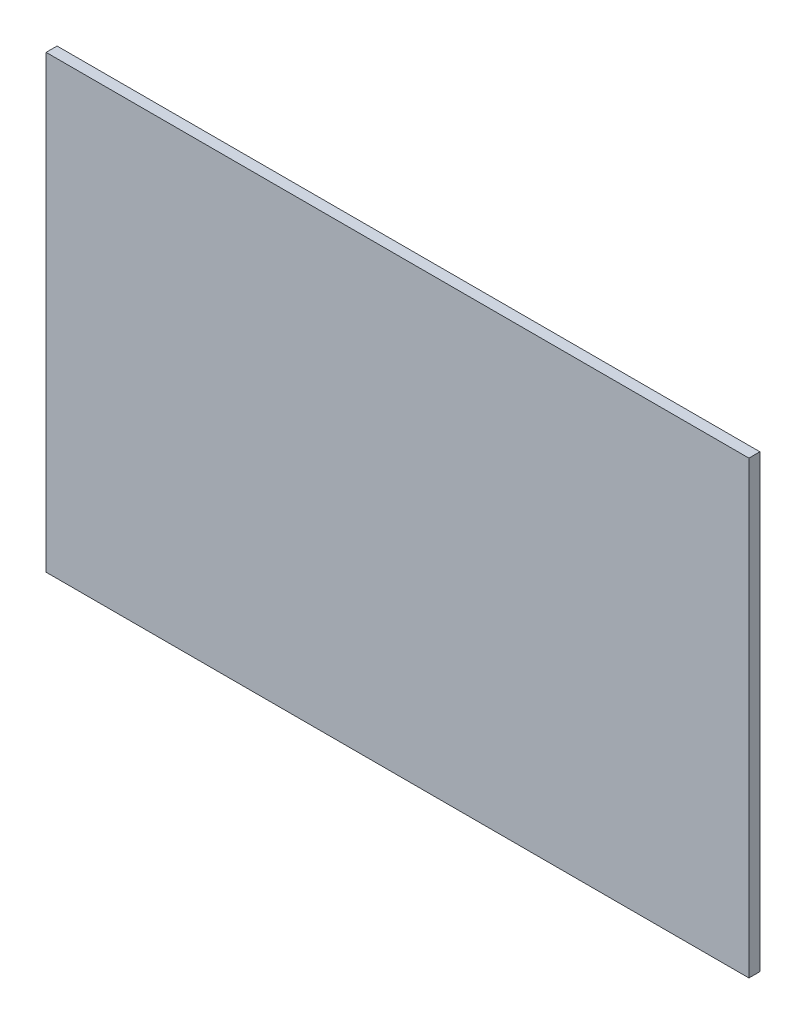
ISO-10303-21;
HEADER;
FILE_DESCRIPTION(('STEP AP214'),'2;1');
FILE_NAME('part.step','',(''),(''),'','','');
FILE_SCHEMA(('AUTOMOTIVE_DESIGN { 1 0 10303 214 1 1 1 1 }'));
ENDSEC;
DATA;
#1=APPLICATION_CONTEXT('core data for automotive mechanical design processes');
#2=APPLICATION_PROTOCOL_DEFINITION('international standard','automotive_design',2000,#1);
#3=PRODUCT_CONTEXT('',#1,'mechanical');
#4=PRODUCT('Part','Part','',(#3));
#5=PRODUCT_RELATED_PRODUCT_CATEGORY('part','',(#4));
#6=PRODUCT_DEFINITION_FORMATION('','',#4);
#7=PRODUCT_DEFINITION_CONTEXT('part definition',#1,'design');
#8=PRODUCT_DEFINITION('design','',#6,#7);
#9=PRODUCT_DEFINITION_SHAPE('','',#8);
#10=(LENGTH_UNIT() NAMED_UNIT(*) SI_UNIT(.MILLI.,.METRE.));
#11=(NAMED_UNIT(*) PLANE_ANGLE_UNIT() SI_UNIT($,.RADIAN.));
#12=(NAMED_UNIT(*) SI_UNIT($,.STERADIAN.) SOLID_ANGLE_UNIT());
#13=UNCERTAINTY_MEASURE_WITH_UNIT(LENGTH_MEASURE(1.E-05),#10,'distance_accuracy_value','');
#14=(GEOMETRIC_REPRESENTATION_CONTEXT(3) GLOBAL_UNCERTAINTY_ASSIGNED_CONTEXT((#13)) GLOBAL_UNIT_ASSIGNED_CONTEXT((#10,
#11,#12)) REPRESENTATION_CONTEXT('',''));
#15=CARTESIAN_POINT('',(0.,0.,0.));
#16=DIRECTION('',(0.,0.,1.));
#17=DIRECTION('',(1.,0.,0.));
#18=AXIS2_PLACEMENT_3D('',#15,#16,#17);
#19=CARTESIAN_POINT('',(160.,102.5,-5.));
#20=DIRECTION('',(1.,0.,0.));
#21=DIRECTION('',(0.,1.,0.));
#22=AXIS2_PLACEMENT_3D('',#19,#20,#21);
#23=PLANE('',#22);
#24=DIRECTION('',(0.,1.,0.));
#25=VECTOR('',#24,1.);
#26=CARTESIAN_POINT('',(160.,102.5,0.));
#27=LINE('',#26,#25);
#28=CARTESIAN_POINT('',(160.,-102.5,0.));
#29=VERTEX_POINT('',#28);
#30=CARTESIAN_POINT('',(160.,102.5,0.));
#31=VERTEX_POINT('',#30);
#32=EDGE_CURVE('E103',#29,#31,#27,.T.);
#33=ORIENTED_EDGE('',*,*,#32,.F.);
#34=DIRECTION('',(0.,0.,1.));
#35=VECTOR('',#34,1.);
#36=CARTESIAN_POINT('',(160.,-102.5,-5.));
#37=LINE('',#36,#35);
#38=CARTESIAN_POINT('',(160.,-102.5,-5.));
#39=VERTEX_POINT('',#38);
#40=EDGE_CURVE('E11',#39,#29,#37,.T.);
#41=ORIENTED_EDGE('',*,*,#40,.F.);
#42=DIRECTION('',(0.,1.,0.));
#43=VECTOR('',#42,1.);
#44=CARTESIAN_POINT('',(160.,102.5,-5.));
#45=LINE('',#44,#43);
#46=CARTESIAN_POINT('',(160.,102.5,-5.));
#47=VERTEX_POINT('',#46);
#48=EDGE_CURVE('E97',#39,#47,#45,.T.);
#49=ORIENTED_EDGE('',*,*,#48,.T.);
#50=DIRECTION('',(0.,0.,1.));
#51=VECTOR('',#50,1.);
#52=CARTESIAN_POINT('',(160.,102.5,-5.));
#53=LINE('',#52,#51);
#54=EDGE_CURVE('E42',#47,#31,#53,.T.);
#55=ORIENTED_EDGE('',*,*,#54,.T.);
#56=EDGE_LOOP('',(#33,#41,#49,#55));
#57=FACE_BOUND('',#56,.T.);
#58=ADVANCED_FACE('F39',(#57),#23,.T.);
#59=CARTESIAN_POINT('',(-160.,-102.5,-5.));
#60=DIRECTION('',(0.,-1.,0.));
#61=DIRECTION('',(0.,0.,-1.));
#62=AXIS2_PLACEMENT_3D('',#59,#60,#61);
#63=PLANE('',#62);
#64=DIRECTION('',(1.,0.,0.));
#65=VECTOR('',#64,1.);
#66=CARTESIAN_POINT('',(-160.,-102.5,0.));
#67=LINE('',#66,#65);
#68=CARTESIAN_POINT('',(-160.,-102.5,0.));
#69=VERTEX_POINT('',#68);
#70=EDGE_CURVE('E99',#69,#29,#67,.T.);
#71=ORIENTED_EDGE('',*,*,#70,.F.);
#72=DIRECTION('',(0.,0.,1.));
#73=VECTOR('',#72,1.);
#74=CARTESIAN_POINT('',(-160.,-102.5,-5.));
#75=LINE('',#74,#73);
#76=CARTESIAN_POINT('',(-160.,-102.5,-5.));
#77=VERTEX_POINT('',#76);
#78=EDGE_CURVE('E48',#77,#69,#75,.T.);
#79=ORIENTED_EDGE('',*,*,#78,.F.);
#80=DIRECTION('',(1.,0.,0.));
#81=VECTOR('',#80,1.);
#82=CARTESIAN_POINT('',(-160.,-102.5,-5.));
#83=LINE('',#82,#81);
#84=EDGE_CURVE('E94',#77,#39,#83,.T.);
#85=ORIENTED_EDGE('',*,*,#84,.T.);
#86=ORIENTED_EDGE('',*,*,#40,.T.);
#87=EDGE_LOOP('',(#71,#79,#85,#86));
#88=FACE_BOUND('',#87,.T.);
#89=ADVANCED_FACE('F113',(#88),#63,.T.);
#90=CARTESIAN_POINT('',(-160.,102.5,-5.));
#91=DIRECTION('',(-1.,0.,0.));
#92=DIRECTION('',(0.,0.,1.));
#93=AXIS2_PLACEMENT_3D('',#90,#91,#92);
#94=PLANE('',#93);
#95=DIRECTION('',(0.,-1.,0.));
#96=VECTOR('',#95,1.);
#97=CARTESIAN_POINT('',(-160.,102.5,0.));
#98=LINE('',#97,#96);
#99=CARTESIAN_POINT('',(-160.,102.5,0.));
#100=VERTEX_POINT('',#99);
#101=EDGE_CURVE('E89',#100,#69,#98,.T.);
#102=ORIENTED_EDGE('',*,*,#101,.F.);
#103=DIRECTION('',(0.,0.,1.));
#104=VECTOR('',#103,1.);
#105=CARTESIAN_POINT('',(-160.,102.5,-5.));
#106=LINE('',#105,#104);
#107=CARTESIAN_POINT('',(-160.,102.5,-5.));
#108=VERTEX_POINT('',#107);
#109=EDGE_CURVE('E84',#108,#100,#106,.T.);
#110=ORIENTED_EDGE('',*,*,#109,.F.);
#111=DIRECTION('',(0.,-1.,0.));
#112=VECTOR('',#111,1.);
#113=CARTESIAN_POINT('',(-160.,102.5,-5.));
#114=LINE('',#113,#112);
#115=EDGE_CURVE('E87',#108,#77,#114,.T.);
#116=ORIENTED_EDGE('',*,*,#115,.T.);
#117=ORIENTED_EDGE('',*,*,#78,.T.);
#118=EDGE_LOOP('',(#102,#110,#116,#117));
#119=FACE_BOUND('',#118,.T.);
#120=ADVANCED_FACE('F86',(#119),#94,.T.);
#121=CARTESIAN_POINT('',(-160.,102.5,-5.));
#122=DIRECTION('',(0.,1.,0.));
#123=DIRECTION('',(0.,0.,1.));
#124=AXIS2_PLACEMENT_3D('',#121,#122,#123);
#125=PLANE('',#124);
#126=DIRECTION('',(-1.,0.,0.));
#127=VECTOR('',#126,1.);
#128=CARTESIAN_POINT('',(-160.,102.5,0.));
#129=LINE('',#128,#127);
#130=EDGE_CURVE('E106',#31,#100,#129,.T.);
#131=ORIENTED_EDGE('',*,*,#130,.F.);
#132=ORIENTED_EDGE('',*,*,#54,.F.);
#133=DIRECTION('',(-1.,0.,0.));
#134=VECTOR('',#133,1.);
#135=CARTESIAN_POINT('',(-160.,102.5,-5.));
#136=LINE('',#135,#134);
#137=EDGE_CURVE('E93',#47,#108,#136,.T.);
#138=ORIENTED_EDGE('',*,*,#137,.T.);
#139=ORIENTED_EDGE('',*,*,#109,.T.);
#140=EDGE_LOOP('',(#131,#132,#138,#139));
#141=FACE_BOUND('',#140,.T.);
#142=ADVANCED_FACE('F96',(#141),#125,.T.);
#143=CARTESIAN_POINT('',(0.,0.,-5.));
#144=DIRECTION('',(0.,0.,1.));
#145=DIRECTION('',(1.,0.,0.));
#146=AXIS2_PLACEMENT_3D('',#143,#144,#145);
#147=PLANE('',#146);
#148=ORIENTED_EDGE('',*,*,#48,.F.);
#149=ORIENTED_EDGE('',*,*,#84,.F.);
#150=ORIENTED_EDGE('',*,*,#115,.F.);
#151=ORIENTED_EDGE('',*,*,#137,.F.);
#152=EDGE_LOOP('',(#148,#149,#150,#151));
#153=FACE_BOUND('',#152,.T.);
#154=ADVANCED_FACE('F92',(#153),#147,.F.);
#155=CARTESIAN_POINT('',(0.,0.,0.));
#156=DIRECTION('',(0.,0.,1.));
#157=DIRECTION('',(1.,0.,0.));
#158=AXIS2_PLACEMENT_3D('',#155,#156,#157);
#159=PLANE('',#158);
#160=ORIENTED_EDGE('',*,*,#32,.T.);
#161=ORIENTED_EDGE('',*,*,#130,.T.);
#162=ORIENTED_EDGE('',*,*,#101,.T.);
#163=ORIENTED_EDGE('',*,*,#70,.T.);
#164=EDGE_LOOP('',(#160,#161,#162,#163));
#165=FACE_BOUND('',#164,.T.);
#166=ADVANCED_FACE('F112',(#165),#159,.T.);
#167=CLOSED_SHELL('',(#58,#89,#120,#142,#154,#166));
#168=MANIFOLD_SOLID_BREP('B2',#167);
#169=ADVANCED_BREP_SHAPE_REPRESENTATION('',(#18,#168),#14);
#170=SHAPE_DEFINITION_REPRESENTATION(#9,#169);
ENDSEC;
END-ISO-10303-21;
